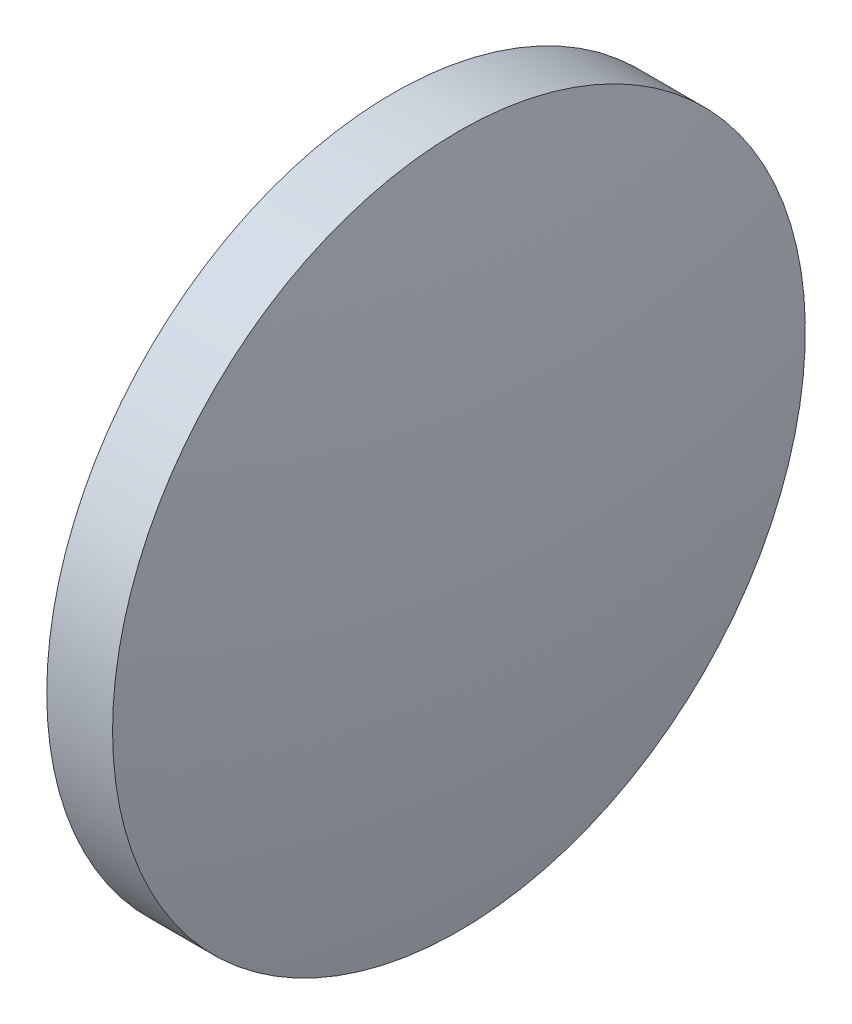
ISO-10303-21;
HEADER;
FILE_DESCRIPTION(('STEP AP214'),'2;1');
FILE_NAME('part.step','',(''),(''),'','','');
FILE_SCHEMA(('AUTOMOTIVE_DESIGN { 1 0 10303 214 1 1 1 1 }'));
ENDSEC;
DATA;
#1=APPLICATION_CONTEXT('core data for automotive mechanical design processes');
#2=APPLICATION_PROTOCOL_DEFINITION('international standard','automotive_design',2000,#1);
#3=PRODUCT_CONTEXT('',#1,'mechanical');
#4=PRODUCT('Part','Part','',(#3));
#5=PRODUCT_RELATED_PRODUCT_CATEGORY('part','',(#4));
#6=PRODUCT_DEFINITION_FORMATION('','',#4);
#7=PRODUCT_DEFINITION_CONTEXT('part definition',#1,'design');
#8=PRODUCT_DEFINITION('design','',#6,#7);
#9=PRODUCT_DEFINITION_SHAPE('','',#8);
#10=(LENGTH_UNIT() NAMED_UNIT(*) SI_UNIT(.MILLI.,.METRE.));
#11=(NAMED_UNIT(*) PLANE_ANGLE_UNIT() SI_UNIT($,.RADIAN.));
#12=(NAMED_UNIT(*) SI_UNIT($,.STERADIAN.) SOLID_ANGLE_UNIT());
#13=UNCERTAINTY_MEASURE_WITH_UNIT(LENGTH_MEASURE(1.E-05),#10,'distance_accuracy_value','');
#14=(GEOMETRIC_REPRESENTATION_CONTEXT(3) GLOBAL_UNCERTAINTY_ASSIGNED_CONTEXT((#13)) GLOBAL_UNIT_ASSIGNED_CONTEXT((#10,
#11,#12)) REPRESENTATION_CONTEXT('',''));
#15=CARTESIAN_POINT('',(0.,0.,0.));
#16=DIRECTION('',(0.,0.,1.));
#17=DIRECTION('',(1.,0.,0.));
#18=AXIS2_PLACEMENT_3D('',#15,#16,#17);
#19=CARTESIAN_POINT('',(569.008732458637,147.602144210551,0.));
#20=DIRECTION('',(-1.,0.,0.));
#21=DIRECTION('',(0.,1.,0.));
#22=AXIS2_PLACEMENT_3D('',#19,#20,#21);
#23=SPHERICAL_SURFACE('',#22,41.415641025641);
#24=CARTESIAN_POINT('',(609.644373484278,147.602144210552,0.));
#25=DIRECTION('',(-1.,0.,0.));
#26=DIRECTION('',(0.,0.,1.));
#27=AXIS2_PLACEMENT_3D('',#24,#25,#26);
#28=CIRCLE('',#27,7.99999999999998);
#29=CARTESIAN_POINT('',(609.644373484278,147.602144210552,7.99999999999998));
#30=VERTEX_POINT('',#29);
#31=EDGE_CURVE('E10',#30,#30,#28,.T.);
#32=ORIENTED_EDGE('',*,*,#31,.F.);
#33=EDGE_LOOP('',(#32));
#34=FACE_BOUND('',#33,.T.);
#35=ADVANCED_FACE('F35',(#34),#23,.T.);
#36=CARTESIAN_POINT('',(606.201556779433,147.602144210552,0.));
#37=DIRECTION('',(-1.,0.,0.));
#38=DIRECTION('',(0.,0.,1.));
#39=AXIS2_PLACEMENT_3D('',#36,#37,#38);
#40=CYLINDRICAL_SURFACE('',#39,7.99999999999998);
#41=CARTESIAN_POINT('',(608.124373484278,147.602144210552,0.));
#42=DIRECTION('',(-1.,0.,0.));
#43=DIRECTION('',(0.,0.,1.));
#44=AXIS2_PLACEMENT_3D('',#41,#42,#43);
#45=CIRCLE('',#44,7.99999999999998);
#46=CARTESIAN_POINT('',(608.124373484278,147.602144210552,7.99999999999998));
#47=VERTEX_POINT('',#46);
#48=EDGE_CURVE('E41',#47,#47,#45,.T.);
#49=ORIENTED_EDGE('',*,*,#48,.F.);
#50=EDGE_LOOP('',(#49));
#51=FACE_BOUND('',#50,.T.);
#52=ORIENTED_EDGE('',*,*,#31,.T.);
#53=EDGE_LOOP('',(#52));
#54=FACE_BOUND('',#53,.T.);
#55=ADVANCED_FACE('F49',(#51,#54),#40,.T.);
#56=CARTESIAN_POINT('',(608.124373484278,147.602144210552,0.));
#57=DIRECTION('',(1.,0.,0.));
#58=DIRECTION('',(0.,0.,-1.));
#59=AXIS2_PLACEMENT_3D('',#56,#57,#58);
#60=PLANE('',#59);
#61=ORIENTED_EDGE('',*,*,#48,.T.);
#62=EDGE_LOOP('',(#61));
#63=FACE_BOUND('',#62,.T.);
#64=ADVANCED_FACE('F47',(#63),#60,.F.);
#65=CLOSED_SHELL('',(#35,#55,#64));
#66=MANIFOLD_SOLID_BREP('B2',#65);
#67=ADVANCED_BREP_SHAPE_REPRESENTATION('',(#18,#66),#14);
#68=SHAPE_DEFINITION_REPRESENTATION(#9,#67);
ENDSEC;
END-ISO-10303-21;
